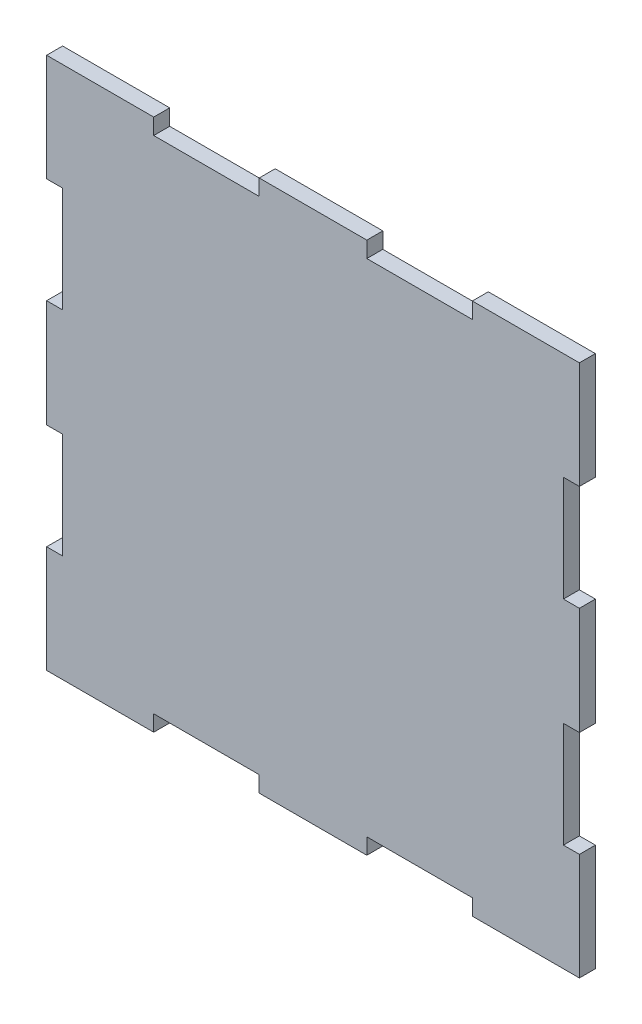
ISO-10303-21;
HEADER;
FILE_DESCRIPTION(('STEP AP214'),'2;1');
FILE_NAME('part.step','',(''),(''),'','','');
FILE_SCHEMA(('AUTOMOTIVE_DESIGN { 1 0 10303 214 1 1 1 1 }'));
ENDSEC;
DATA;
#1=APPLICATION_CONTEXT('core data for automotive mechanical design processes');
#2=APPLICATION_PROTOCOL_DEFINITION('international standard','automotive_design',2000,#1);
#3=PRODUCT_CONTEXT('',#1,'mechanical');
#4=PRODUCT('Part','Part','',(#3));
#5=PRODUCT_RELATED_PRODUCT_CATEGORY('part','',(#4));
#6=PRODUCT_DEFINITION_FORMATION('','',#4);
#7=PRODUCT_DEFINITION_CONTEXT('part definition',#1,'design');
#8=PRODUCT_DEFINITION('design','',#6,#7);
#9=PRODUCT_DEFINITION_SHAPE('','',#8);
#10=(LENGTH_UNIT() NAMED_UNIT(*) SI_UNIT(.MILLI.,.METRE.));
#11=(NAMED_UNIT(*) PLANE_ANGLE_UNIT() SI_UNIT($,.RADIAN.));
#12=(NAMED_UNIT(*) SI_UNIT($,.STERADIAN.) SOLID_ANGLE_UNIT());
#13=UNCERTAINTY_MEASURE_WITH_UNIT(LENGTH_MEASURE(1.E-05),#10,'distance_accuracy_value','');
#14=(GEOMETRIC_REPRESENTATION_CONTEXT(3) GLOBAL_UNCERTAINTY_ASSIGNED_CONTEXT((#13)) GLOBAL_UNIT_ASSIGNED_CONTEXT((#10,
#11,#12)) REPRESENTATION_CONTEXT('',''));
#15=CARTESIAN_POINT('',(0.,0.,0.));
#16=DIRECTION('',(0.,0.,1.));
#17=DIRECTION('',(1.,0.,0.));
#18=AXIS2_PLACEMENT_3D('',#15,#16,#17);
#19=CARTESIAN_POINT('',(-5.91378797783615E-12,79.899999999993,3.));
#20=DIRECTION('',(0.,-1.,0.));
#21=DIRECTION('',(1.,0.,0.));
#22=AXIS2_PLACEMENT_3D('',#19,#20,#21);
#23=PLANE('',#22);
#24=DIRECTION('',(-1.,0.,0.));
#25=VECTOR('',#24,1.);
#26=CARTESIAN_POINT('',(-5.91378797783615E-12,79.899999999993,0.));
#27=LINE('',#26,#25);
#28=CARTESIAN_POINT('',(100.,79.9000000000003,0.));
#29=VERTEX_POINT('',#28);
#30=CARTESIAN_POINT('',(97.0000000000001,79.9000000000002,0.));
#31=VERTEX_POINT('',#30);
#32=EDGE_CURVE('E301',#29,#31,#27,.T.);
#33=ORIENTED_EDGE('',*,*,#32,.F.);
#34=DIRECTION('',(0.,0.,-1.));
#35=VECTOR('',#34,1.);
#36=CARTESIAN_POINT('',(100.,79.9000000000003,3.));
#37=LINE('',#36,#35);
#38=CARTESIAN_POINT('',(100.,79.9000000000003,3.));
#39=VERTEX_POINT('',#38);
#40=EDGE_CURVE('E11',#39,#29,#37,.T.);
#41=ORIENTED_EDGE('',*,*,#40,.F.);
#42=DIRECTION('',(-1.,0.,0.));
#43=VECTOR('',#42,1.);
#44=CARTESIAN_POINT('',(-5.91378797783615E-12,79.899999999993,3.));
#45=LINE('',#44,#43);
#46=CARTESIAN_POINT('',(97.0000000000001,79.9000000000002,3.));
#47=VERTEX_POINT('',#46);
#48=EDGE_CURVE('E385',#39,#47,#45,.T.);
#49=ORIENTED_EDGE('',*,*,#48,.T.);
#50=DIRECTION('',(0.,0.,-1.));
#51=VECTOR('',#50,1.);
#52=CARTESIAN_POINT('',(97.0000000000001,79.9000000000002,3.));
#53=LINE('',#52,#51);
#54=EDGE_CURVE('E52',#47,#31,#53,.T.);
#55=ORIENTED_EDGE('',*,*,#54,.T.);
#56=EDGE_LOOP('',(#33,#41,#49,#55));
#57=FACE_BOUND('',#56,.T.);
#58=ADVANCED_FACE('F36',(#57),#23,.T.);
#59=CARTESIAN_POINT('',(100.,0.,3.));
#60=DIRECTION('',(-1.,0.,0.));
#61=DIRECTION('',(0.,-1.,0.));
#62=AXIS2_PLACEMENT_3D('',#59,#60,#61);
#63=PLANE('',#62);
#64=DIRECTION('',(0.,1.,0.));
#65=VECTOR('',#64,1.);
#66=CARTESIAN_POINT('',(100.,0.,0.));
#67=LINE('',#66,#65);
#68=CARTESIAN_POINT('',(100.,100.,0.));
#69=VERTEX_POINT('',#68);
#70=EDGE_CURVE('E303',#29,#69,#67,.T.);
#71=ORIENTED_EDGE('',*,*,#70,.T.);
#72=DIRECTION('',(0.,0.,-1.));
#73=VECTOR('',#72,1.);
#74=CARTESIAN_POINT('',(100.,100.,3.));
#75=LINE('',#74,#73);
#76=CARTESIAN_POINT('',(100.,100.,3.));
#77=VERTEX_POINT('',#76);
#78=EDGE_CURVE('E44',#77,#69,#75,.T.);
#79=ORIENTED_EDGE('',*,*,#78,.F.);
#80=DIRECTION('',(0.,1.,0.));
#81=VECTOR('',#80,1.);
#82=CARTESIAN_POINT('',(100.,0.,3.));
#83=LINE('',#82,#81);
#84=EDGE_CURVE('E284',#39,#77,#83,.T.);
#85=ORIENTED_EDGE('',*,*,#84,.F.);
#86=ORIENTED_EDGE('',*,*,#40,.T.);
#87=EDGE_LOOP('',(#71,#79,#85,#86));
#88=FACE_BOUND('',#87,.T.);
#89=ADVANCED_FACE('F465',(#88),#63,.F.);
#90=CARTESIAN_POINT('',(0.,100.,3.));
#91=DIRECTION('',(0.,1.,0.));
#92=DIRECTION('',(0.,0.,1.));
#93=AXIS2_PLACEMENT_3D('',#90,#91,#92);
#94=PLANE('',#93);
#95=DIRECTION('',(1.,0.,0.));
#96=VECTOR('',#95,1.);
#97=CARTESIAN_POINT('',(0.,100.,0.));
#98=LINE('',#97,#96);
#99=CARTESIAN_POINT('',(79.9,100.,0.));
#100=VERTEX_POINT('',#99);
#101=EDGE_CURVE('E306',#100,#69,#98,.T.);
#102=ORIENTED_EDGE('',*,*,#101,.F.);
#103=DIRECTION('',(0.,0.,-1.));
#104=VECTOR('',#103,1.);
#105=CARTESIAN_POINT('',(79.9,100.,3.));
#106=LINE('',#105,#104);
#107=CARTESIAN_POINT('',(79.9,100.,3.));
#108=VERTEX_POINT('',#107);
#109=EDGE_CURVE('E455',#108,#100,#106,.T.);
#110=ORIENTED_EDGE('',*,*,#109,.F.);
#111=DIRECTION('',(1.,0.,0.));
#112=VECTOR('',#111,1.);
#113=CARTESIAN_POINT('',(0.,100.,3.));
#114=LINE('',#113,#112);
#115=EDGE_CURVE('E462',#108,#77,#114,.T.);
#116=ORIENTED_EDGE('',*,*,#115,.T.);
#117=ORIENTED_EDGE('',*,*,#78,.T.);
#118=EDGE_LOOP('',(#102,#110,#116,#117));
#119=FACE_BOUND('',#118,.T.);
#120=ADVANCED_FACE('F460',(#119),#94,.T.);
#121=CARTESIAN_POINT('',(79.9,0.,3.));
#122=DIRECTION('',(1.,0.,0.));
#123=DIRECTION('',(0.,0.,-1.));
#124=AXIS2_PLACEMENT_3D('',#121,#122,#123);
#125=PLANE('',#124);
#126=DIRECTION('',(0.,-1.,0.));
#127=VECTOR('',#126,1.);
#128=CARTESIAN_POINT('',(79.9,0.,0.));
#129=LINE('',#128,#127);
#130=CARTESIAN_POINT('',(79.9,97.,0.));
#131=VERTEX_POINT('',#130);
#132=EDGE_CURVE('E310',#100,#131,#129,.T.);
#133=ORIENTED_EDGE('',*,*,#132,.T.);
#134=DIRECTION('',(0.,0.,-1.));
#135=VECTOR('',#134,1.);
#136=CARTESIAN_POINT('',(79.9,97.,3.));
#137=LINE('',#136,#135);
#138=CARTESIAN_POINT('',(79.9,97.,3.));
#139=VERTEX_POINT('',#138);
#140=EDGE_CURVE('E453',#139,#131,#137,.T.);
#141=ORIENTED_EDGE('',*,*,#140,.F.);
#142=DIRECTION('',(0.,-1.,0.));
#143=VECTOR('',#142,1.);
#144=CARTESIAN_POINT('',(79.9,0.,3.));
#145=LINE('',#144,#143);
#146=EDGE_CURVE('E475',#108,#139,#145,.T.);
#147=ORIENTED_EDGE('',*,*,#146,.F.);
#148=ORIENTED_EDGE('',*,*,#109,.T.);
#149=EDGE_LOOP('',(#133,#141,#147,#148));
#150=FACE_BOUND('',#149,.T.);
#151=ADVANCED_FACE('F472',(#150),#125,.F.);
#152=CARTESIAN_POINT('',(0.,97.,3.));
#153=DIRECTION('',(0.,1.,0.));
#154=DIRECTION('',(0.,0.,1.));
#155=AXIS2_PLACEMENT_3D('',#152,#153,#154);
#156=PLANE('',#155);
#157=DIRECTION('',(1.,0.,0.));
#158=VECTOR('',#157,1.);
#159=CARTESIAN_POINT('',(0.,97.,0.));
#160=LINE('',#159,#158);
#161=CARTESIAN_POINT('',(60.1,97.,0.));
#162=VERTEX_POINT('',#161);
#163=EDGE_CURVE('E315',#162,#131,#160,.T.);
#164=ORIENTED_EDGE('',*,*,#163,.F.);
#165=DIRECTION('',(0.,0.,-1.));
#166=VECTOR('',#165,1.);
#167=CARTESIAN_POINT('',(60.1,97.,3.));
#168=LINE('',#167,#166);
#169=CARTESIAN_POINT('',(60.1,97.,3.));
#170=VERTEX_POINT('',#169);
#171=EDGE_CURVE('E451',#170,#162,#168,.T.);
#172=ORIENTED_EDGE('',*,*,#171,.F.);
#173=DIRECTION('',(1.,0.,0.));
#174=VECTOR('',#173,1.);
#175=CARTESIAN_POINT('',(0.,97.,3.));
#176=LINE('',#175,#174);
#177=EDGE_CURVE('E477',#170,#139,#176,.T.);
#178=ORIENTED_EDGE('',*,*,#177,.T.);
#179=ORIENTED_EDGE('',*,*,#140,.T.);
#180=EDGE_LOOP('',(#164,#172,#178,#179));
#181=FACE_BOUND('',#180,.T.);
#182=ADVANCED_FACE('F683',(#181),#156,.T.);
#183=CARTESIAN_POINT('',(60.1,0.,3.));
#184=DIRECTION('',(1.,0.,0.));
#185=DIRECTION('',(0.,0.,-1.));
#186=AXIS2_PLACEMENT_3D('',#183,#184,#185);
#187=PLANE('',#186);
#188=DIRECTION('',(0.,-1.,0.));
#189=VECTOR('',#188,1.);
#190=CARTESIAN_POINT('',(60.1,0.,0.));
#191=LINE('',#190,#189);
#192=CARTESIAN_POINT('',(60.1,100.,0.));
#193=VERTEX_POINT('',#192);
#194=EDGE_CURVE('E318',#193,#162,#191,.T.);
#195=ORIENTED_EDGE('',*,*,#194,.F.);
#196=DIRECTION('',(0.,0.,-1.));
#197=VECTOR('',#196,1.);
#198=CARTESIAN_POINT('',(60.1,100.,3.));
#199=LINE('',#198,#197);
#200=CARTESIAN_POINT('',(60.1,100.,3.));
#201=VERTEX_POINT('',#200);
#202=EDGE_CURVE('E449',#201,#193,#199,.T.);
#203=ORIENTED_EDGE('',*,*,#202,.F.);
#204=DIRECTION('',(0.,-1.,0.));
#205=VECTOR('',#204,1.);
#206=CARTESIAN_POINT('',(60.1,0.,3.));
#207=LINE('',#206,#205);
#208=EDGE_CURVE('E487',#201,#170,#207,.T.);
#209=ORIENTED_EDGE('',*,*,#208,.T.);
#210=ORIENTED_EDGE('',*,*,#171,.T.);
#211=EDGE_LOOP('',(#195,#203,#209,#210));
#212=FACE_BOUND('',#211,.T.);
#213=ADVANCED_FACE('F680',(#212),#187,.T.);
#214=CARTESIAN_POINT('',(39.9,100.,0.));
#215=VERTEX_POINT('',#214);
#216=EDGE_CURVE('E312',#215,#193,#98,.T.);
#217=ORIENTED_EDGE('',*,*,#216,.F.);
#218=DIRECTION('',(0.,0.,-1.));
#219=VECTOR('',#218,1.);
#220=CARTESIAN_POINT('',(39.9,100.,3.));
#221=LINE('',#220,#219);
#222=CARTESIAN_POINT('',(39.9,100.,3.));
#223=VERTEX_POINT('',#222);
#224=EDGE_CURVE('E447',#223,#215,#221,.T.);
#225=ORIENTED_EDGE('',*,*,#224,.F.);
#226=EDGE_CURVE('E481',#223,#201,#114,.T.);
#227=ORIENTED_EDGE('',*,*,#226,.T.);
#228=ORIENTED_EDGE('',*,*,#202,.T.);
#229=EDGE_LOOP('',(#217,#225,#227,#228));
#230=FACE_BOUND('',#229,.T.);
#231=ADVANCED_FACE('F594',(#230),#94,.T.);
#232=CARTESIAN_POINT('',(39.9,0.,3.));
#233=DIRECTION('',(1.,0.,0.));
#234=DIRECTION('',(0.,0.,-1.));
#235=AXIS2_PLACEMENT_3D('',#232,#233,#234);
#236=PLANE('',#235);
#237=DIRECTION('',(0.,-1.,0.));
#238=VECTOR('',#237,1.);
#239=CARTESIAN_POINT('',(39.9,0.,0.));
#240=LINE('',#239,#238);
#241=CARTESIAN_POINT('',(39.9,97.,0.));
#242=VERTEX_POINT('',#241);
#243=EDGE_CURVE('E321',#215,#242,#240,.T.);
#244=ORIENTED_EDGE('',*,*,#243,.T.);
#245=DIRECTION('',(0.,0.,-1.));
#246=VECTOR('',#245,1.);
#247=CARTESIAN_POINT('',(39.9,97.,3.));
#248=LINE('',#247,#246);
#249=CARTESIAN_POINT('',(39.9,97.,3.));
#250=VERTEX_POINT('',#249);
#251=EDGE_CURVE('E445',#250,#242,#248,.T.);
#252=ORIENTED_EDGE('',*,*,#251,.F.);
#253=DIRECTION('',(0.,-1.,0.));
#254=VECTOR('',#253,1.);
#255=CARTESIAN_POINT('',(39.9,0.,3.));
#256=LINE('',#255,#254);
#257=EDGE_CURVE('E486',#223,#250,#256,.T.);
#258=ORIENTED_EDGE('',*,*,#257,.F.);
#259=ORIENTED_EDGE('',*,*,#224,.T.);
#260=EDGE_LOOP('',(#244,#252,#258,#259));
#261=FACE_BOUND('',#260,.T.);
#262=ADVANCED_FACE('F675',(#261),#236,.F.);
#263=CARTESIAN_POINT('',(0.,97.,3.));
#264=DIRECTION('',(0.,1.,0.));
#265=DIRECTION('',(0.,0.,1.));
#266=AXIS2_PLACEMENT_3D('',#263,#264,#265);
#267=PLANE('',#266);
#268=DIRECTION('',(1.,0.,0.));
#269=VECTOR('',#268,1.);
#270=CARTESIAN_POINT('',(0.,97.,0.));
#271=LINE('',#270,#269);
#272=CARTESIAN_POINT('',(20.1,97.,0.));
#273=VERTEX_POINT('',#272);
#274=EDGE_CURVE('E324',#273,#242,#271,.T.);
#275=ORIENTED_EDGE('',*,*,#274,.F.);
#276=DIRECTION('',(0.,0.,-1.));
#277=VECTOR('',#276,1.);
#278=CARTESIAN_POINT('',(20.1,97.,3.));
#279=LINE('',#278,#277);
#280=CARTESIAN_POINT('',(20.1,97.,3.));
#281=VERTEX_POINT('',#280);
#282=EDGE_CURVE('E443',#281,#273,#279,.T.);
#283=ORIENTED_EDGE('',*,*,#282,.F.);
#284=DIRECTION('',(1.,0.,0.));
#285=VECTOR('',#284,1.);
#286=CARTESIAN_POINT('',(0.,97.,3.));
#287=LINE('',#286,#285);
#288=EDGE_CURVE('E490',#281,#250,#287,.T.);
#289=ORIENTED_EDGE('',*,*,#288,.T.);
#290=ORIENTED_EDGE('',*,*,#251,.T.);
#291=EDGE_LOOP('',(#275,#283,#289,#290));
#292=FACE_BOUND('',#291,.T.);
#293=ADVANCED_FACE('F671',(#292),#267,.T.);
#294=CARTESIAN_POINT('',(20.1,0.,3.));
#295=DIRECTION('',(1.,0.,0.));
#296=DIRECTION('',(0.,0.,-1.));
#297=AXIS2_PLACEMENT_3D('',#294,#295,#296);
#298=PLANE('',#297);
#299=DIRECTION('',(0.,-1.,0.));
#300=VECTOR('',#299,1.);
#301=CARTESIAN_POINT('',(20.1,0.,0.));
#302=LINE('',#301,#300);
#303=CARTESIAN_POINT('',(20.1,100.,0.));
#304=VERTEX_POINT('',#303);
#305=EDGE_CURVE('E327',#304,#273,#302,.T.);
#306=ORIENTED_EDGE('',*,*,#305,.F.);
#307=DIRECTION('',(0.,0.,-1.));
#308=VECTOR('',#307,1.);
#309=CARTESIAN_POINT('',(20.1,100.,3.));
#310=LINE('',#309,#308);
#311=CARTESIAN_POINT('',(20.1,100.,3.));
#312=VERTEX_POINT('',#311);
#313=EDGE_CURVE('E441',#312,#304,#310,.T.);
#314=ORIENTED_EDGE('',*,*,#313,.F.);
#315=DIRECTION('',(0.,-1.,0.));
#316=VECTOR('',#315,1.);
#317=CARTESIAN_POINT('',(20.1,0.,3.));
#318=LINE('',#317,#316);
#319=EDGE_CURVE('E484',#312,#281,#318,.T.);
#320=ORIENTED_EDGE('',*,*,#319,.T.);
#321=ORIENTED_EDGE('',*,*,#282,.T.);
#322=EDGE_LOOP('',(#306,#314,#320,#321));
#323=FACE_BOUND('',#322,.T.);
#324=ADVANCED_FACE('F667',(#323),#298,.T.);
#325=CARTESIAN_POINT('',(0.,100.,0.));
#326=VERTEX_POINT('',#325);
#327=EDGE_CURVE('E311',#326,#304,#98,.T.);
#328=ORIENTED_EDGE('',*,*,#327,.F.);
#329=DIRECTION('',(0.,0.,-1.));
#330=VECTOR('',#329,1.);
#331=CARTESIAN_POINT('',(0.,100.,3.));
#332=LINE('',#331,#330);
#333=CARTESIAN_POINT('',(0.,100.,3.));
#334=VERTEX_POINT('',#333);
#335=EDGE_CURVE('E439',#334,#326,#332,.T.);
#336=ORIENTED_EDGE('',*,*,#335,.F.);
#337=EDGE_CURVE('E480',#334,#312,#114,.T.);
#338=ORIENTED_EDGE('',*,*,#337,.T.);
#339=ORIENTED_EDGE('',*,*,#313,.T.);
#340=EDGE_LOOP('',(#328,#336,#338,#339));
#341=FACE_BOUND('',#340,.T.);
#342=ADVANCED_FACE('F595',(#341),#94,.T.);
#343=CARTESIAN_POINT('',(0.,0.,3.));
#344=DIRECTION('',(-1.,0.,0.));
#345=DIRECTION('',(0.,-1.,0.));
#346=AXIS2_PLACEMENT_3D('',#343,#344,#345);
#347=PLANE('',#346);
#348=DIRECTION('',(0.,1.,0.));
#349=VECTOR('',#348,1.);
#350=CARTESIAN_POINT('',(0.,0.,0.));
#351=LINE('',#350,#349);
#352=CARTESIAN_POINT('',(0.,79.9,0.));
#353=VERTEX_POINT('',#352);
#354=EDGE_CURVE('E330',#353,#326,#351,.T.);
#355=ORIENTED_EDGE('',*,*,#354,.F.);
#356=DIRECTION('',(0.,0.,-1.));
#357=VECTOR('',#356,1.);
#358=CARTESIAN_POINT('',(0.,79.9,3.));
#359=LINE('',#358,#357);
#360=CARTESIAN_POINT('',(0.,79.9,3.));
#361=VERTEX_POINT('',#360);
#362=EDGE_CURVE('E437',#361,#353,#359,.T.);
#363=ORIENTED_EDGE('',*,*,#362,.F.);
#364=DIRECTION('',(0.,1.,0.));
#365=VECTOR('',#364,1.);
#366=CARTESIAN_POINT('',(0.,0.,3.));
#367=LINE('',#366,#365);
#368=EDGE_CURVE('E483',#361,#334,#367,.T.);
#369=ORIENTED_EDGE('',*,*,#368,.T.);
#370=ORIENTED_EDGE('',*,*,#335,.T.);
#371=EDGE_LOOP('',(#355,#363,#369,#370));
#372=FACE_BOUND('',#371,.T.);
#373=ADVANCED_FACE('F641',(#372),#347,.T.);
#374=CARTESIAN_POINT('',(0.,79.9,3.));
#375=DIRECTION('',(0.,1.,0.));
#376=DIRECTION('',(0.,0.,1.));
#377=AXIS2_PLACEMENT_3D('',#374,#375,#376);
#378=PLANE('',#377);
#379=DIRECTION('',(1.,0.,0.));
#380=VECTOR('',#379,1.);
#381=CARTESIAN_POINT('',(0.,79.9,0.));
#382=LINE('',#381,#380);
#383=CARTESIAN_POINT('',(3.,79.9,0.));
#384=VERTEX_POINT('',#383);
#385=EDGE_CURVE('E333',#353,#384,#382,.T.);
#386=ORIENTED_EDGE('',*,*,#385,.T.);
#387=DIRECTION('',(0.,0.,-1.));
#388=VECTOR('',#387,1.);
#389=CARTESIAN_POINT('',(3.,79.9,3.));
#390=LINE('',#389,#388);
#391=CARTESIAN_POINT('',(3.,79.9,3.));
#392=VERTEX_POINT('',#391);
#393=EDGE_CURVE('E434',#392,#384,#390,.T.);
#394=ORIENTED_EDGE('',*,*,#393,.F.);
#395=DIRECTION('',(1.,0.,0.));
#396=VECTOR('',#395,1.);
#397=CARTESIAN_POINT('',(0.,79.9,3.));
#398=LINE('',#397,#396);
#399=EDGE_CURVE('E504',#361,#392,#398,.T.);
#400=ORIENTED_EDGE('',*,*,#399,.F.);
#401=ORIENTED_EDGE('',*,*,#362,.T.);
#402=EDGE_LOOP('',(#386,#394,#400,#401));
#403=FACE_BOUND('',#402,.T.);
#404=ADVANCED_FACE('F661',(#403),#378,.F.);
#405=CARTESIAN_POINT('',(3.00000000000001,0.,3.));
#406=DIRECTION('',(1.,0.,0.));
#407=DIRECTION('',(0.,1.,0.));
#408=AXIS2_PLACEMENT_3D('',#405,#406,#407);
#409=PLANE('',#408);
#410=DIRECTION('',(0.,-1.,0.));
#411=VECTOR('',#410,1.);
#412=CARTESIAN_POINT('',(3.00000000000001,0.,0.));
#413=LINE('',#412,#411);
#414=CARTESIAN_POINT('',(3.,60.1,0.));
#415=VERTEX_POINT('',#414);
#416=EDGE_CURVE('E337',#384,#415,#413,.T.);
#417=ORIENTED_EDGE('',*,*,#416,.T.);
#418=DIRECTION('',(0.,0.,-1.));
#419=VECTOR('',#418,1.);
#420=CARTESIAN_POINT('',(3.,60.1,3.));
#421=LINE('',#420,#419);
#422=CARTESIAN_POINT('',(3.,60.1,3.));
#423=VERTEX_POINT('',#422);
#424=EDGE_CURVE('E432',#423,#415,#421,.T.);
#425=ORIENTED_EDGE('',*,*,#424,.F.);
#426=DIRECTION('',(0.,-1.,0.));
#427=VECTOR('',#426,1.);
#428=CARTESIAN_POINT('',(3.00000000000001,0.,3.));
#429=LINE('',#428,#427);
#430=EDGE_CURVE('E508',#392,#423,#429,.T.);
#431=ORIENTED_EDGE('',*,*,#430,.F.);
#432=ORIENTED_EDGE('',*,*,#393,.T.);
#433=EDGE_LOOP('',(#417,#425,#431,#432));
#434=FACE_BOUND('',#433,.T.);
#435=ADVANCED_FACE('F657',(#434),#409,.F.);
#436=CARTESIAN_POINT('',(0.,60.1,3.));
#437=DIRECTION('',(0.,1.,0.));
#438=DIRECTION('',(0.,0.,1.));
#439=AXIS2_PLACEMENT_3D('',#436,#437,#438);
#440=PLANE('',#439);
#441=DIRECTION('',(1.,0.,0.));
#442=VECTOR('',#441,1.);
#443=CARTESIAN_POINT('',(0.,60.1,0.));
#444=LINE('',#443,#442);
#445=CARTESIAN_POINT('',(0.,60.1,0.));
#446=VERTEX_POINT('',#445);
#447=EDGE_CURVE('E340',#446,#415,#444,.T.);
#448=ORIENTED_EDGE('',*,*,#447,.F.);
#449=DIRECTION('',(0.,0.,-1.));
#450=VECTOR('',#449,1.);
#451=CARTESIAN_POINT('',(0.,60.1,3.));
#452=LINE('',#451,#450);
#453=CARTESIAN_POINT('',(0.,60.1,3.));
#454=VERTEX_POINT('',#453);
#455=EDGE_CURVE('E430',#454,#446,#452,.T.);
#456=ORIENTED_EDGE('',*,*,#455,.F.);
#457=DIRECTION('',(1.,0.,0.));
#458=VECTOR('',#457,1.);
#459=CARTESIAN_POINT('',(0.,60.1,3.));
#460=LINE('',#459,#458);
#461=EDGE_CURVE('E510',#454,#423,#460,.T.);
#462=ORIENTED_EDGE('',*,*,#461,.T.);
#463=ORIENTED_EDGE('',*,*,#424,.T.);
#464=EDGE_LOOP('',(#448,#456,#462,#463));
#465=FACE_BOUND('',#464,.T.);
#466=ADVANCED_FACE('F654',(#465),#440,.T.);
#467=CARTESIAN_POINT('',(0.,39.9,0.));
#468=VERTEX_POINT('',#467);
#469=EDGE_CURVE('E335',#468,#446,#351,.T.);
#470=ORIENTED_EDGE('',*,*,#469,.F.);
#471=DIRECTION('',(0.,0.,-1.));
#472=VECTOR('',#471,1.);
#473=CARTESIAN_POINT('',(0.,39.9,3.));
#474=LINE('',#473,#472);
#475=CARTESIAN_POINT('',(0.,39.9,3.));
#476=VERTEX_POINT('',#475);
#477=EDGE_CURVE('E428',#476,#468,#474,.T.);
#478=ORIENTED_EDGE('',*,*,#477,.F.);
#479=EDGE_CURVE('E506',#476,#454,#367,.T.);
#480=ORIENTED_EDGE('',*,*,#479,.T.);
#481=ORIENTED_EDGE('',*,*,#455,.T.);
#482=EDGE_LOOP('',(#470,#478,#480,#481));
#483=FACE_BOUND('',#482,.T.);
#484=ADVANCED_FACE('F642',(#483),#347,.T.);
#485=CARTESIAN_POINT('',(0.,39.9,3.));
#486=DIRECTION('',(0.,1.,0.));
#487=DIRECTION('',(0.,0.,1.));
#488=AXIS2_PLACEMENT_3D('',#485,#486,#487);
#489=PLANE('',#488);
#490=DIRECTION('',(1.,0.,0.));
#491=VECTOR('',#490,1.);
#492=CARTESIAN_POINT('',(0.,39.9,0.));
#493=LINE('',#492,#491);
#494=CARTESIAN_POINT('',(3.00000000000042,39.9,0.));
#495=VERTEX_POINT('',#494);
#496=EDGE_CURVE('E343',#468,#495,#493,.T.);
#497=ORIENTED_EDGE('',*,*,#496,.T.);
#498=DIRECTION('',(0.,0.,-1.));
#499=VECTOR('',#498,1.);
#500=CARTESIAN_POINT('',(3.00000000000042,39.9,3.));
#501=LINE('',#500,#499);
#502=CARTESIAN_POINT('',(3.00000000000042,39.9,3.));
#503=VERTEX_POINT('',#502);
#504=EDGE_CURVE('E425',#503,#495,#501,.T.);
#505=ORIENTED_EDGE('',*,*,#504,.F.);
#506=DIRECTION('',(1.,0.,0.));
#507=VECTOR('',#506,1.);
#508=CARTESIAN_POINT('',(0.,39.9,3.));
#509=LINE('',#508,#507);
#510=EDGE_CURVE('E513',#476,#503,#509,.T.);
#511=ORIENTED_EDGE('',*,*,#510,.F.);
#512=ORIENTED_EDGE('',*,*,#477,.T.);
#513=EDGE_LOOP('',(#497,#505,#511,#512));
#514=FACE_BOUND('',#513,.T.);
#515=ADVANCED_FACE('F649',(#514),#489,.F.);
#516=CARTESIAN_POINT('',(3.00000000000042,0.,3.));
#517=DIRECTION('',(1.,0.,0.));
#518=DIRECTION('',(0.,1.,0.));
#519=AXIS2_PLACEMENT_3D('',#516,#517,#518);
#520=PLANE('',#519);
#521=DIRECTION('',(0.,-1.,0.));
#522=VECTOR('',#521,1.);
#523=CARTESIAN_POINT('',(3.00000000000042,0.,0.));
#524=LINE('',#523,#522);
#525=CARTESIAN_POINT('',(3.00000000000042,20.1,0.));
#526=VERTEX_POINT('',#525);
#527=EDGE_CURVE('E345',#495,#526,#524,.T.);
#528=ORIENTED_EDGE('',*,*,#527,.T.);
#529=DIRECTION('',(0.,0.,-1.));
#530=VECTOR('',#529,1.);
#531=CARTESIAN_POINT('',(3.00000000000042,20.1,3.));
#532=LINE('',#531,#530);
#533=CARTESIAN_POINT('',(3.00000000000042,20.1,3.));
#534=VERTEX_POINT('',#533);
#535=EDGE_CURVE('E423',#534,#526,#532,.T.);
#536=ORIENTED_EDGE('',*,*,#535,.F.);
#537=DIRECTION('',(0.,-1.,0.));
#538=VECTOR('',#537,1.);
#539=CARTESIAN_POINT('',(3.00000000000042,0.,3.));
#540=LINE('',#539,#538);
#541=EDGE_CURVE('E515',#503,#534,#540,.T.);
#542=ORIENTED_EDGE('',*,*,#541,.F.);
#543=ORIENTED_EDGE('',*,*,#504,.T.);
#544=EDGE_LOOP('',(#528,#536,#542,#543));
#545=FACE_BOUND('',#544,.T.);
#546=ADVANCED_FACE('F645',(#545),#520,.F.);
#547=CARTESIAN_POINT('',(0.,20.1,3.));
#548=DIRECTION('',(0.,1.,0.));
#549=DIRECTION('',(0.,0.,1.));
#550=AXIS2_PLACEMENT_3D('',#547,#548,#549);
#551=PLANE('',#550);
#552=DIRECTION('',(1.,0.,0.));
#553=VECTOR('',#552,1.);
#554=CARTESIAN_POINT('',(0.,20.1,0.));
#555=LINE('',#554,#553);
#556=CARTESIAN_POINT('',(0.,20.1,0.));
#557=VERTEX_POINT('',#556);
#558=EDGE_CURVE('E348',#557,#526,#555,.T.);
#559=ORIENTED_EDGE('',*,*,#558,.F.);
#560=DIRECTION('',(0.,0.,-1.));
#561=VECTOR('',#560,1.);
#562=CARTESIAN_POINT('',(0.,20.1,3.));
#563=LINE('',#562,#561);
#564=CARTESIAN_POINT('',(0.,20.1,3.));
#565=VERTEX_POINT('',#564);
#566=EDGE_CURVE('E421',#565,#557,#563,.T.);
#567=ORIENTED_EDGE('',*,*,#566,.F.);
#568=DIRECTION('',(1.,0.,0.));
#569=VECTOR('',#568,1.);
#570=CARTESIAN_POINT('',(0.,20.1,3.));
#571=LINE('',#570,#569);
#572=EDGE_CURVE('E517',#565,#534,#571,.T.);
#573=ORIENTED_EDGE('',*,*,#572,.T.);
#574=ORIENTED_EDGE('',*,*,#535,.T.);
#575=EDGE_LOOP('',(#559,#567,#573,#574));
#576=FACE_BOUND('',#575,.T.);
#577=ADVANCED_FACE('F639',(#576),#551,.T.);
#578=CARTESIAN_POINT('',(0.,0.,0.));
#579=VERTEX_POINT('',#578);
#580=EDGE_CURVE('E334',#579,#557,#351,.T.);
#581=ORIENTED_EDGE('',*,*,#580,.F.);
#582=DIRECTION('',(0.,0.,-1.));
#583=VECTOR('',#582,1.);
#584=CARTESIAN_POINT('',(0.,0.,3.));
#585=LINE('',#584,#583);
#586=CARTESIAN_POINT('',(0.,0.,3.));
#587=VERTEX_POINT('',#586);
#588=EDGE_CURVE('E419',#587,#579,#585,.T.);
#589=ORIENTED_EDGE('',*,*,#588,.F.);
#590=EDGE_CURVE('E505',#587,#565,#367,.T.);
#591=ORIENTED_EDGE('',*,*,#590,.T.);
#592=ORIENTED_EDGE('',*,*,#566,.T.);
#593=EDGE_LOOP('',(#581,#589,#591,#592));
#594=FACE_BOUND('',#593,.T.);
#595=ADVANCED_FACE('F636',(#594),#347,.T.);
#596=CARTESIAN_POINT('',(0.,0.,3.));
#597=DIRECTION('',(0.,1.,0.));
#598=DIRECTION('',(0.,0.,1.));
#599=AXIS2_PLACEMENT_3D('',#596,#597,#598);
#600=PLANE('',#599);
#601=DIRECTION('',(1.,0.,0.));
#602=VECTOR('',#601,1.);
#603=CARTESIAN_POINT('',(0.,0.,0.));
#604=LINE('',#603,#602);
#605=CARTESIAN_POINT('',(20.1,0.,0.));
#606=VERTEX_POINT('',#605);
#607=EDGE_CURVE('E351',#579,#606,#604,.T.);
#608=ORIENTED_EDGE('',*,*,#607,.T.);
#609=DIRECTION('',(0.,0.,-1.));
#610=VECTOR('',#609,1.);
#611=CARTESIAN_POINT('',(20.1,0.,3.));
#612=LINE('',#611,#610);
#613=CARTESIAN_POINT('',(20.1,0.,3.));
#614=VERTEX_POINT('',#613);
#615=EDGE_CURVE('E416',#614,#606,#612,.T.);
#616=ORIENTED_EDGE('',*,*,#615,.F.);
#617=DIRECTION('',(1.,0.,0.));
#618=VECTOR('',#617,1.);
#619=CARTESIAN_POINT('',(0.,0.,3.));
#620=LINE('',#619,#618);
#621=EDGE_CURVE('E520',#587,#614,#620,.T.);
#622=ORIENTED_EDGE('',*,*,#621,.F.);
#623=ORIENTED_EDGE('',*,*,#588,.T.);
#624=EDGE_LOOP('',(#608,#616,#622,#623));
#625=FACE_BOUND('',#624,.T.);
#626=ADVANCED_FACE('F616',(#625),#600,.F.);
#627=CARTESIAN_POINT('',(20.1,0.,3.));
#628=DIRECTION('',(-1.,0.,0.));
#629=DIRECTION('',(0.,0.,1.));
#630=AXIS2_PLACEMENT_3D('',#627,#628,#629);
#631=PLANE('',#630);
#632=DIRECTION('',(0.,1.,0.));
#633=VECTOR('',#632,1.);
#634=CARTESIAN_POINT('',(20.1,0.,0.));
#635=LINE('',#634,#633);
#636=CARTESIAN_POINT('',(20.1,3.,0.));
#637=VERTEX_POINT('',#636);
#638=EDGE_CURVE('E353',#606,#637,#635,.T.);
#639=ORIENTED_EDGE('',*,*,#638,.T.);
#640=DIRECTION('',(0.,0.,-1.));
#641=VECTOR('',#640,1.);
#642=CARTESIAN_POINT('',(20.1,3.,3.));
#643=LINE('',#642,#641);
#644=CARTESIAN_POINT('',(20.1,3.,3.));
#645=VERTEX_POINT('',#644);
#646=EDGE_CURVE('E413',#645,#637,#643,.T.);
#647=ORIENTED_EDGE('',*,*,#646,.F.);
#648=DIRECTION('',(0.,1.,0.));
#649=VECTOR('',#648,1.);
#650=CARTESIAN_POINT('',(20.1,0.,3.));
#651=LINE('',#650,#649);
#652=EDGE_CURVE('E522',#614,#645,#651,.T.);
#653=ORIENTED_EDGE('',*,*,#652,.F.);
#654=ORIENTED_EDGE('',*,*,#615,.T.);
#655=EDGE_LOOP('',(#639,#647,#653,#654));
#656=FACE_BOUND('',#655,.T.);
#657=ADVANCED_FACE('F631',(#656),#631,.F.);
#658=CARTESIAN_POINT('',(0.,3.,3.));
#659=DIRECTION('',(0.,1.,0.));
#660=DIRECTION('',(0.,0.,1.));
#661=AXIS2_PLACEMENT_3D('',#658,#659,#660);
#662=PLANE('',#661);
#663=DIRECTION('',(1.,0.,0.));
#664=VECTOR('',#663,1.);
#665=CARTESIAN_POINT('',(0.,3.,0.));
#666=LINE('',#665,#664);
#667=CARTESIAN_POINT('',(39.9,3.,0.));
#668=VERTEX_POINT('',#667);
#669=EDGE_CURVE('E357',#637,#668,#666,.T.);
#670=ORIENTED_EDGE('',*,*,#669,.T.);
#671=DIRECTION('',(0.,0.,-1.));
#672=VECTOR('',#671,1.);
#673=CARTESIAN_POINT('',(39.9,3.,3.));
#674=LINE('',#673,#672);
#675=CARTESIAN_POINT('',(39.9,3.,3.));
#676=VERTEX_POINT('',#675);
#677=EDGE_CURVE('E411',#676,#668,#674,.T.);
#678=ORIENTED_EDGE('',*,*,#677,.F.);
#679=DIRECTION('',(1.,0.,0.));
#680=VECTOR('',#679,1.);
#681=CARTESIAN_POINT('',(0.,3.,3.));
#682=LINE('',#681,#680);
#683=EDGE_CURVE('E526',#645,#676,#682,.T.);
#684=ORIENTED_EDGE('',*,*,#683,.F.);
#685=ORIENTED_EDGE('',*,*,#646,.T.);
#686=EDGE_LOOP('',(#670,#678,#684,#685));
#687=FACE_BOUND('',#686,.T.);
#688=ADVANCED_FACE('F627',(#687),#662,.F.);
#689=CARTESIAN_POINT('',(39.9,0.,3.));
#690=DIRECTION('',(-1.,0.,0.));
#691=DIRECTION('',(0.,0.,1.));
#692=AXIS2_PLACEMENT_3D('',#689,#690,#691);
#693=PLANE('',#692);
#694=DIRECTION('',(0.,1.,0.));
#695=VECTOR('',#694,1.);
#696=CARTESIAN_POINT('',(39.9,0.,0.));
#697=LINE('',#696,#695);
#698=CARTESIAN_POINT('',(39.9,0.,0.));
#699=VERTEX_POINT('',#698);
#700=EDGE_CURVE('E360',#699,#668,#697,.T.);
#701=ORIENTED_EDGE('',*,*,#700,.F.);
#702=DIRECTION('',(0.,0.,-1.));
#703=VECTOR('',#702,1.);
#704=CARTESIAN_POINT('',(39.9,0.,3.));
#705=LINE('',#704,#703);
#706=CARTESIAN_POINT('',(39.9,0.,3.));
#707=VERTEX_POINT('',#706);
#708=EDGE_CURVE('E409',#707,#699,#705,.T.);
#709=ORIENTED_EDGE('',*,*,#708,.F.);
#710=DIRECTION('',(0.,1.,0.));
#711=VECTOR('',#710,1.);
#712=CARTESIAN_POINT('',(39.9,0.,3.));
#713=LINE('',#712,#711);
#714=EDGE_CURVE('E528',#707,#676,#713,.T.);
#715=ORIENTED_EDGE('',*,*,#714,.T.);
#716=ORIENTED_EDGE('',*,*,#677,.T.);
#717=EDGE_LOOP('',(#701,#709,#715,#716));
#718=FACE_BOUND('',#717,.T.);
#719=ADVANCED_FACE('F624',(#718),#693,.T.);
#720=CARTESIAN_POINT('',(60.1,0.,0.));
#721=VERTEX_POINT('',#720);
#722=EDGE_CURVE('E355',#699,#721,#604,.T.);
#723=ORIENTED_EDGE('',*,*,#722,.T.);
#724=DIRECTION('',(0.,0.,-1.));
#725=VECTOR('',#724,1.);
#726=CARTESIAN_POINT('',(60.1,0.,3.));
#727=LINE('',#726,#725);
#728=CARTESIAN_POINT('',(60.1,0.,3.));
#729=VERTEX_POINT('',#728);
#730=EDGE_CURVE('E406',#729,#721,#727,.T.);
#731=ORIENTED_EDGE('',*,*,#730,.F.);
#732=EDGE_CURVE('E524',#707,#729,#620,.T.);
#733=ORIENTED_EDGE('',*,*,#732,.F.);
#734=ORIENTED_EDGE('',*,*,#708,.T.);
#735=EDGE_LOOP('',(#723,#731,#733,#734));
#736=FACE_BOUND('',#735,.T.);
#737=ADVANCED_FACE('F555',(#736),#600,.F.);
#738=CARTESIAN_POINT('',(60.1,0.,3.));
#739=DIRECTION('',(-1.,0.,0.));
#740=DIRECTION('',(0.,0.,1.));
#741=AXIS2_PLACEMENT_3D('',#738,#739,#740);
#742=PLANE('',#741);
#743=DIRECTION('',(0.,1.,0.));
#744=VECTOR('',#743,1.);
#745=CARTESIAN_POINT('',(60.1,0.,0.));
#746=LINE('',#745,#744);
#747=CARTESIAN_POINT('',(60.1,3.,0.));
#748=VERTEX_POINT('',#747);
#749=EDGE_CURVE('E363',#721,#748,#746,.T.);
#750=ORIENTED_EDGE('',*,*,#749,.T.);
#751=DIRECTION('',(0.,0.,-1.));
#752=VECTOR('',#751,1.);
#753=CARTESIAN_POINT('',(60.1,3.,3.));
#754=LINE('',#753,#752);
#755=CARTESIAN_POINT('',(60.1,3.,3.));
#756=VERTEX_POINT('',#755);
#757=EDGE_CURVE('E403',#756,#748,#754,.T.);
#758=ORIENTED_EDGE('',*,*,#757,.F.);
#759=DIRECTION('',(0.,1.,0.));
#760=VECTOR('',#759,1.);
#761=CARTESIAN_POINT('',(60.1,0.,3.));
#762=LINE('',#761,#760);
#763=EDGE_CURVE('E531',#729,#756,#762,.T.);
#764=ORIENTED_EDGE('',*,*,#763,.F.);
#765=ORIENTED_EDGE('',*,*,#730,.T.);
#766=EDGE_LOOP('',(#750,#758,#764,#765));
#767=FACE_BOUND('',#766,.T.);
#768=ADVANCED_FACE('F561',(#767),#742,.F.);
#769=CARTESIAN_POINT('',(0.,3.,3.));
#770=DIRECTION('',(0.,1.,0.));
#771=DIRECTION('',(0.,0.,1.));
#772=AXIS2_PLACEMENT_3D('',#769,#770,#771);
#773=PLANE('',#772);
#774=DIRECTION('',(1.,0.,0.));
#775=VECTOR('',#774,1.);
#776=CARTESIAN_POINT('',(0.,3.,0.));
#777=LINE('',#776,#775);
#778=CARTESIAN_POINT('',(79.9,3.,0.));
#779=VERTEX_POINT('',#778);
#780=EDGE_CURVE('E365',#748,#779,#777,.T.);
#781=ORIENTED_EDGE('',*,*,#780,.T.);
#782=DIRECTION('',(0.,0.,-1.));
#783=VECTOR('',#782,1.);
#784=CARTESIAN_POINT('',(79.9,3.,3.));
#785=LINE('',#784,#783);
#786=CARTESIAN_POINT('',(79.9,3.,3.));
#787=VERTEX_POINT('',#786);
#788=EDGE_CURVE('E401',#787,#779,#785,.T.);
#789=ORIENTED_EDGE('',*,*,#788,.F.);
#790=DIRECTION('',(1.,0.,0.));
#791=VECTOR('',#790,1.);
#792=CARTESIAN_POINT('',(0.,3.,3.));
#793=LINE('',#792,#791);
#794=EDGE_CURVE('E533',#756,#787,#793,.T.);
#795=ORIENTED_EDGE('',*,*,#794,.F.);
#796=ORIENTED_EDGE('',*,*,#757,.T.);
#797=EDGE_LOOP('',(#781,#789,#795,#796));
#798=FACE_BOUND('',#797,.T.);
#799=ADVANCED_FACE('F567',(#798),#773,.F.);
#800=CARTESIAN_POINT('',(79.9,0.,3.));
#801=DIRECTION('',(-1.,0.,0.));
#802=DIRECTION('',(0.,0.,1.));
#803=AXIS2_PLACEMENT_3D('',#800,#801,#802);
#804=PLANE('',#803);
#805=DIRECTION('',(0.,1.,0.));
#806=VECTOR('',#805,1.);
#807=CARTESIAN_POINT('',(79.9,0.,0.));
#808=LINE('',#807,#806);
#809=CARTESIAN_POINT('',(79.9,0.,0.));
#810=VERTEX_POINT('',#809);
#811=EDGE_CURVE('E368',#810,#779,#808,.T.);
#812=ORIENTED_EDGE('',*,*,#811,.F.);
#813=DIRECTION('',(0.,0.,-1.));
#814=VECTOR('',#813,1.);
#815=CARTESIAN_POINT('',(79.9,0.,3.));
#816=LINE('',#815,#814);
#817=CARTESIAN_POINT('',(79.9,0.,3.));
#818=VERTEX_POINT('',#817);
#819=EDGE_CURVE('E399',#818,#810,#816,.T.);
#820=ORIENTED_EDGE('',*,*,#819,.F.);
#821=DIRECTION('',(0.,1.,0.));
#822=VECTOR('',#821,1.);
#823=CARTESIAN_POINT('',(79.9,0.,3.));
#824=LINE('',#823,#822);
#825=EDGE_CURVE('E535',#818,#787,#824,.T.);
#826=ORIENTED_EDGE('',*,*,#825,.T.);
#827=ORIENTED_EDGE('',*,*,#788,.T.);
#828=EDGE_LOOP('',(#812,#820,#826,#827));
#829=FACE_BOUND('',#828,.T.);
#830=ADVANCED_FACE('F615',(#829),#804,.T.);
#831=CARTESIAN_POINT('',(100.,0.,0.));
#832=VERTEX_POINT('',#831);
#833=EDGE_CURVE('E354',#810,#832,#604,.T.);
#834=ORIENTED_EDGE('',*,*,#833,.T.);
#835=DIRECTION('',(0.,0.,-1.));
#836=VECTOR('',#835,1.);
#837=CARTESIAN_POINT('',(100.,0.,3.));
#838=LINE('',#837,#836);
#839=CARTESIAN_POINT('',(100.,0.,3.));
#840=VERTEX_POINT('',#839);
#841=EDGE_CURVE('E396',#840,#832,#838,.T.);
#842=ORIENTED_EDGE('',*,*,#841,.F.);
#843=EDGE_CURVE('E523',#818,#840,#620,.T.);
#844=ORIENTED_EDGE('',*,*,#843,.F.);
#845=ORIENTED_EDGE('',*,*,#819,.T.);
#846=EDGE_LOOP('',(#834,#842,#844,#845));
#847=FACE_BOUND('',#846,.T.);
#848=ADVANCED_FACE('F599',(#847),#600,.F.);
#849=CARTESIAN_POINT('',(100.,20.1000000000003,0.));
#850=VERTEX_POINT('',#849);
#851=EDGE_CURVE('E307',#832,#850,#67,.T.);
#852=ORIENTED_EDGE('',*,*,#851,.T.);
#853=DIRECTION('',(0.,0.,-1.));
#854=VECTOR('',#853,1.);
#855=CARTESIAN_POINT('',(100.,20.1000000000003,3.));
#856=LINE('',#855,#854);
#857=CARTESIAN_POINT('',(100.,20.1000000000003,3.));
#858=VERTEX_POINT('',#857);
#859=EDGE_CURVE('E393',#858,#850,#856,.T.);
#860=ORIENTED_EDGE('',*,*,#859,.F.);
#861=EDGE_CURVE('E283',#840,#858,#83,.T.);
#862=ORIENTED_EDGE('',*,*,#861,.F.);
#863=ORIENTED_EDGE('',*,*,#841,.T.);
#864=EDGE_LOOP('',(#852,#860,#862,#863));
#865=FACE_BOUND('',#864,.T.);
#866=ADVANCED_FACE('F589',(#865),#63,.F.);
#867=CARTESIAN_POINT('',(-1.4876988529972E-12,20.099999999993,3.));
#868=DIRECTION('',(0.,-1.,0.));
#869=DIRECTION('',(1.,0.,0.));
#870=AXIS2_PLACEMENT_3D('',#867,#868,#869);
#871=PLANE('',#870);
#872=DIRECTION('',(-1.,0.,0.));
#873=VECTOR('',#872,1.);
#874=CARTESIAN_POINT('',(-1.4876988529972E-12,20.099999999993,0.));
#875=LINE('',#874,#873);
#876=CARTESIAN_POINT('',(97.0000000000001,20.1000000000002,0.));
#877=VERTEX_POINT('',#876);
#878=EDGE_CURVE('E371',#850,#877,#875,.T.);
#879=ORIENTED_EDGE('',*,*,#878,.T.);
#880=DIRECTION('',(0.,0.,-1.));
#881=VECTOR('',#880,1.);
#882=CARTESIAN_POINT('',(97.0000000000001,20.1000000000002,3.));
#883=LINE('',#882,#881);
#884=CARTESIAN_POINT('',(97.0000000000001,20.1000000000002,3.));
#885=VERTEX_POINT('',#884);
#886=EDGE_CURVE('E391',#885,#877,#883,.T.);
#887=ORIENTED_EDGE('',*,*,#886,.F.);
#888=DIRECTION('',(-1.,0.,0.));
#889=VECTOR('',#888,1.);
#890=CARTESIAN_POINT('',(-1.4876988529972E-12,20.099999999993,3.));
#891=LINE('',#890,#889);
#892=EDGE_CURVE('E538',#858,#885,#891,.T.);
#893=ORIENTED_EDGE('',*,*,#892,.F.);
#894=ORIENTED_EDGE('',*,*,#859,.T.);
#895=EDGE_LOOP('',(#879,#887,#893,#894));
#896=FACE_BOUND('',#895,.T.);
#897=ADVANCED_FACE('F598',(#896),#871,.F.);
#898=CARTESIAN_POINT('',(97.0000000000002,6.79871422908084E-13,3.));
#899=DIRECTION('',(1.,0.,0.));
#900=DIRECTION('',(0.,1.,0.));
#901=AXIS2_PLACEMENT_3D('',#898,#899,#900);
#902=PLANE('',#901);
#903=DIRECTION('',(0.,-1.,0.));
#904=VECTOR('',#903,1.);
#905=CARTESIAN_POINT('',(97.0000000000002,6.79871422908084E-13,0.));
#906=LINE('',#905,#904);
#907=CARTESIAN_POINT('',(96.9999999999999,39.9000000000002,0.));
#908=VERTEX_POINT('',#907);
#909=EDGE_CURVE('E374',#908,#877,#906,.T.);
#910=ORIENTED_EDGE('',*,*,#909,.F.);
#911=DIRECTION('',(0.,0.,-1.));
#912=VECTOR('',#911,1.);
#913=CARTESIAN_POINT('',(96.9999999999999,39.9000000000002,3.));
#914=LINE('',#913,#912);
#915=CARTESIAN_POINT('',(96.9999999999999,39.9000000000002,3.));
#916=VERTEX_POINT('',#915);
#917=EDGE_CURVE('E389',#916,#908,#914,.T.);
#918=ORIENTED_EDGE('',*,*,#917,.F.);
#919=DIRECTION('',(0.,-1.,0.));
#920=VECTOR('',#919,1.);
#921=CARTESIAN_POINT('',(97.0000000000002,6.79871422908084E-13,3.));
#922=LINE('',#921,#920);
#923=EDGE_CURVE('E539',#916,#885,#922,.T.);
#924=ORIENTED_EDGE('',*,*,#923,.T.);
#925=ORIENTED_EDGE('',*,*,#886,.T.);
#926=EDGE_LOOP('',(#910,#918,#924,#925));
#927=FACE_BOUND('',#926,.T.);
#928=ADVANCED_FACE('F604',(#927),#902,.T.);
#929=CARTESIAN_POINT('',(-2.95319324550241E-12,39.899999999993,3.));
#930=DIRECTION('',(0.,-1.,0.));
#931=DIRECTION('',(1.,0.,0.));
#932=AXIS2_PLACEMENT_3D('',#929,#930,#931);
#933=PLANE('',#932);
#934=DIRECTION('',(-1.,0.,0.));
#935=VECTOR('',#934,1.);
#936=CARTESIAN_POINT('',(-2.95319324550241E-12,39.899999999993,0.));
#937=LINE('',#936,#935);
#938=CARTESIAN_POINT('',(100.,39.9000000000003,0.));
#939=VERTEX_POINT('',#938);
#940=EDGE_CURVE('E377',#939,#908,#937,.T.);
#941=ORIENTED_EDGE('',*,*,#940,.F.);
#942=DIRECTION('',(0.,0.,-1.));
#943=VECTOR('',#942,1.);
#944=CARTESIAN_POINT('',(100.,39.9000000000003,3.));
#945=LINE('',#944,#943);
#946=CARTESIAN_POINT('',(100.,39.9000000000003,3.));
#947=VERTEX_POINT('',#946);
#948=EDGE_CURVE('E292',#947,#939,#945,.T.);
#949=ORIENTED_EDGE('',*,*,#948,.F.);
#950=DIRECTION('',(-1.,0.,0.));
#951=VECTOR('',#950,1.);
#952=CARTESIAN_POINT('',(-2.95319324550241E-12,39.899999999993,3.));
#953=LINE('',#952,#951);
#954=EDGE_CURVE('E280',#947,#916,#953,.T.);
#955=ORIENTED_EDGE('',*,*,#954,.T.);
#956=ORIENTED_EDGE('',*,*,#917,.T.);
#957=EDGE_LOOP('',(#941,#949,#955,#956));
#958=FACE_BOUND('',#957,.T.);
#959=ADVANCED_FACE('F544',(#958),#933,.T.);
#960=CARTESIAN_POINT('',(100.,60.1000000000003,0.));
#961=VERTEX_POINT('',#960);
#962=EDGE_CURVE('E289',#939,#961,#67,.T.);
#963=ORIENTED_EDGE('',*,*,#962,.T.);
#964=DIRECTION('',(0.,0.,-1.));
#965=VECTOR('',#964,1.);
#966=CARTESIAN_POINT('',(100.,60.1000000000003,3.));
#967=LINE('',#966,#965);
#968=CARTESIAN_POINT('',(100.,60.1000000000003,3.));
#969=VERTEX_POINT('',#968);
#970=EDGE_CURVE('E286',#969,#961,#967,.T.);
#971=ORIENTED_EDGE('',*,*,#970,.F.);
#972=EDGE_CURVE('E271',#947,#969,#83,.T.);
#973=ORIENTED_EDGE('',*,*,#972,.F.);
#974=ORIENTED_EDGE('',*,*,#948,.T.);
#975=EDGE_LOOP('',(#963,#971,#973,#974));
#976=FACE_BOUND('',#975,.T.);
#977=ADVANCED_FACE('F287',(#976),#63,.F.);
#978=CARTESIAN_POINT('',(-4.44829358533094E-12,60.099999999993,3.));
#979=DIRECTION('',(0.,-1.,0.));
#980=DIRECTION('',(1.,0.,0.));
#981=AXIS2_PLACEMENT_3D('',#978,#979,#980);
#982=PLANE('',#981);
#983=DIRECTION('',(-1.,0.,0.));
#984=VECTOR('',#983,1.);
#985=CARTESIAN_POINT('',(-4.44829358533094E-12,60.099999999993,0.));
#986=LINE('',#985,#984);
#987=CARTESIAN_POINT('',(97.0000000000002,60.1000000000002,0.));
#988=VERTEX_POINT('',#987);
#989=EDGE_CURVE('E380',#961,#988,#986,.T.);
#990=ORIENTED_EDGE('',*,*,#989,.T.);
#991=DIRECTION('',(0.,0.,-1.));
#992=VECTOR('',#991,1.);
#993=CARTESIAN_POINT('',(97.0000000000002,60.1000000000002,3.));
#994=LINE('',#993,#992);
#995=CARTESIAN_POINT('',(97.0000000000002,60.1000000000002,3.));
#996=VERTEX_POINT('',#995);
#997=EDGE_CURVE('E162',#996,#988,#994,.T.);
#998=ORIENTED_EDGE('',*,*,#997,.F.);
#999=DIRECTION('',(-1.,0.,0.));
#1000=VECTOR('',#999,1.);
#1001=CARTESIAN_POINT('',(-4.44829358533094E-12,60.099999999993,3.));
#1002=LINE('',#1001,#1000);
#1003=EDGE_CURVE('E277',#969,#996,#1002,.T.);
#1004=ORIENTED_EDGE('',*,*,#1003,.F.);
#1005=ORIENTED_EDGE('',*,*,#970,.T.);
#1006=EDGE_LOOP('',(#990,#998,#1004,#1005));
#1007=FACE_BOUND('',#1006,.T.);
#1008=ADVANCED_FACE('F294',(#1007),#982,.F.);
#1009=CARTESIAN_POINT('',(97.0000000000006,6.79871422908087E-13,3.));
#1010=DIRECTION('',(1.,0.,0.));
#1011=DIRECTION('',(0.,1.,0.));
#1012=AXIS2_PLACEMENT_3D('',#1009,#1010,#1011);
#1013=PLANE('',#1012);
#1014=DIRECTION('',(0.,-1.,0.));
#1015=VECTOR('',#1014,1.);
#1016=CARTESIAN_POINT('',(97.0000000000006,6.79871422908087E-13,0.));
#1017=LINE('',#1016,#1015);
#1018=EDGE_CURVE('E382',#31,#988,#1017,.T.);
#1019=ORIENTED_EDGE('',*,*,#1018,.F.);
#1020=ORIENTED_EDGE('',*,*,#54,.F.);
#1021=DIRECTION('',(0.,-1.,0.));
#1022=VECTOR('',#1021,1.);
#1023=CARTESIAN_POINT('',(97.0000000000006,6.79871422908087E-13,3.));
#1024=LINE('',#1023,#1022);
#1025=EDGE_CURVE('E295',#47,#996,#1024,.T.);
#1026=ORIENTED_EDGE('',*,*,#1025,.T.);
#1027=ORIENTED_EDGE('',*,*,#997,.T.);
#1028=EDGE_LOOP('',(#1019,#1020,#1026,#1027));
#1029=FACE_BOUND('',#1028,.T.);
#1030=ADVANCED_FACE('F574',(#1029),#1013,.T.);
#1031=CARTESIAN_POINT('',(0.,0.,3.));
#1032=DIRECTION('',(0.,0.,1.));
#1033=DIRECTION('',(1.,0.,0.));
#1034=AXIS2_PLACEMENT_3D('',#1031,#1032,#1033);
#1035=PLANE('',#1034);
#1036=ORIENTED_EDGE('',*,*,#48,.F.);
#1037=ORIENTED_EDGE('',*,*,#84,.T.);
#1038=ORIENTED_EDGE('',*,*,#115,.F.);
#1039=ORIENTED_EDGE('',*,*,#146,.T.);
#1040=ORIENTED_EDGE('',*,*,#177,.F.);
#1041=ORIENTED_EDGE('',*,*,#208,.F.);
#1042=ORIENTED_EDGE('',*,*,#226,.F.);
#1043=ORIENTED_EDGE('',*,*,#257,.T.);
#1044=ORIENTED_EDGE('',*,*,#288,.F.);
#1045=ORIENTED_EDGE('',*,*,#319,.F.);
#1046=ORIENTED_EDGE('',*,*,#337,.F.);
#1047=ORIENTED_EDGE('',*,*,#368,.F.);
#1048=ORIENTED_EDGE('',*,*,#399,.T.);
#1049=ORIENTED_EDGE('',*,*,#430,.T.);
#1050=ORIENTED_EDGE('',*,*,#461,.F.);
#1051=ORIENTED_EDGE('',*,*,#479,.F.);
#1052=ORIENTED_EDGE('',*,*,#510,.T.);
#1053=ORIENTED_EDGE('',*,*,#541,.T.);
#1054=ORIENTED_EDGE('',*,*,#572,.F.);
#1055=ORIENTED_EDGE('',*,*,#590,.F.);
#1056=ORIENTED_EDGE('',*,*,#621,.T.);
#1057=ORIENTED_EDGE('',*,*,#652,.T.);
#1058=ORIENTED_EDGE('',*,*,#683,.T.);
#1059=ORIENTED_EDGE('',*,*,#714,.F.);
#1060=ORIENTED_EDGE('',*,*,#732,.T.);
#1061=ORIENTED_EDGE('',*,*,#763,.T.);
#1062=ORIENTED_EDGE('',*,*,#794,.T.);
#1063=ORIENTED_EDGE('',*,*,#825,.F.);
#1064=ORIENTED_EDGE('',*,*,#843,.T.);
#1065=ORIENTED_EDGE('',*,*,#861,.T.);
#1066=ORIENTED_EDGE('',*,*,#892,.T.);
#1067=ORIENTED_EDGE('',*,*,#923,.F.);
#1068=ORIENTED_EDGE('',*,*,#954,.F.);
#1069=ORIENTED_EDGE('',*,*,#972,.T.);
#1070=ORIENTED_EDGE('',*,*,#1003,.T.);
#1071=ORIENTED_EDGE('',*,*,#1025,.F.);
#1072=EDGE_LOOP('',(#1036,#1037,#1038,#1039,#1040,#1041,#1042,#1043,#1044,#1045,#1046,#1047,
#1048,#1049,#1050,#1051,#1052,#1053,#1054,#1055,#1056,#1057,#1058,#1059,#1060,#1061,#1062,#1063,
#1064,#1065,#1066,#1067,#1068,#1069,#1070,#1071));
#1073=FACE_BOUND('',#1072,.T.);
#1074=ADVANCED_FACE('F274',(#1073),#1035,.T.);
#1075=CARTESIAN_POINT('',(0.,0.,0.));
#1076=DIRECTION('',(0.,0.,1.));
#1077=DIRECTION('',(1.,0.,0.));
#1078=AXIS2_PLACEMENT_3D('',#1075,#1076,#1077);
#1079=PLANE('',#1078);
#1080=ORIENTED_EDGE('',*,*,#32,.T.);
#1081=ORIENTED_EDGE('',*,*,#1018,.T.);
#1082=ORIENTED_EDGE('',*,*,#989,.F.);
#1083=ORIENTED_EDGE('',*,*,#962,.F.);
#1084=ORIENTED_EDGE('',*,*,#940,.T.);
#1085=ORIENTED_EDGE('',*,*,#909,.T.);
#1086=ORIENTED_EDGE('',*,*,#878,.F.);
#1087=ORIENTED_EDGE('',*,*,#851,.F.);
#1088=ORIENTED_EDGE('',*,*,#833,.F.);
#1089=ORIENTED_EDGE('',*,*,#811,.T.);
#1090=ORIENTED_EDGE('',*,*,#780,.F.);
#1091=ORIENTED_EDGE('',*,*,#749,.F.);
#1092=ORIENTED_EDGE('',*,*,#722,.F.);
#1093=ORIENTED_EDGE('',*,*,#700,.T.);
#1094=ORIENTED_EDGE('',*,*,#669,.F.);
#1095=ORIENTED_EDGE('',*,*,#638,.F.);
#1096=ORIENTED_EDGE('',*,*,#607,.F.);
#1097=ORIENTED_EDGE('',*,*,#580,.T.);
#1098=ORIENTED_EDGE('',*,*,#558,.T.);
#1099=ORIENTED_EDGE('',*,*,#527,.F.);
#1100=ORIENTED_EDGE('',*,*,#496,.F.);
#1101=ORIENTED_EDGE('',*,*,#469,.T.);
#1102=ORIENTED_EDGE('',*,*,#447,.T.);
#1103=ORIENTED_EDGE('',*,*,#416,.F.);
#1104=ORIENTED_EDGE('',*,*,#385,.F.);
#1105=ORIENTED_EDGE('',*,*,#354,.T.);
#1106=ORIENTED_EDGE('',*,*,#327,.T.);
#1107=ORIENTED_EDGE('',*,*,#305,.T.);
#1108=ORIENTED_EDGE('',*,*,#274,.T.);
#1109=ORIENTED_EDGE('',*,*,#243,.F.);
#1110=ORIENTED_EDGE('',*,*,#216,.T.);
#1111=ORIENTED_EDGE('',*,*,#194,.T.);
#1112=ORIENTED_EDGE('',*,*,#163,.T.);
#1113=ORIENTED_EDGE('',*,*,#132,.F.);
#1114=ORIENTED_EDGE('',*,*,#101,.T.);
#1115=ORIENTED_EDGE('',*,*,#70,.F.);
#1116=EDGE_LOOP('',(#1080,#1081,#1082,#1083,#1084,#1085,#1086,#1087,#1088,#1089,#1090,#1091,
#1092,#1093,#1094,#1095,#1096,#1097,#1098,#1099,#1100,#1101,#1102,#1103,#1104,#1105,#1106,#1107,
#1108,#1109,#1110,#1111,#1112,#1113,#1114,#1115));
#1117=FACE_BOUND('',#1116,.T.);
#1118=ADVANCED_FACE('F468',(#1117),#1079,.F.);
#1119=CLOSED_SHELL('',(#58,#89,#120,#151,#182,#213,#231,#262,#293,#324,#342,#373,#404,#435,#466,
#484,#515,#546,#577,#595,#626,#657,#688,#719,#737,#768,#799,#830,#848,#866,#897,#928,#959,#977,
#1008,#1030,#1074,#1118));
#1120=MANIFOLD_SOLID_BREP('B2',#1119);
#1121=ADVANCED_BREP_SHAPE_REPRESENTATION('',(#18,#1120),#14);
#1122=SHAPE_DEFINITION_REPRESENTATION(#9,#1121);
ENDSEC;
END-ISO-10303-21;
